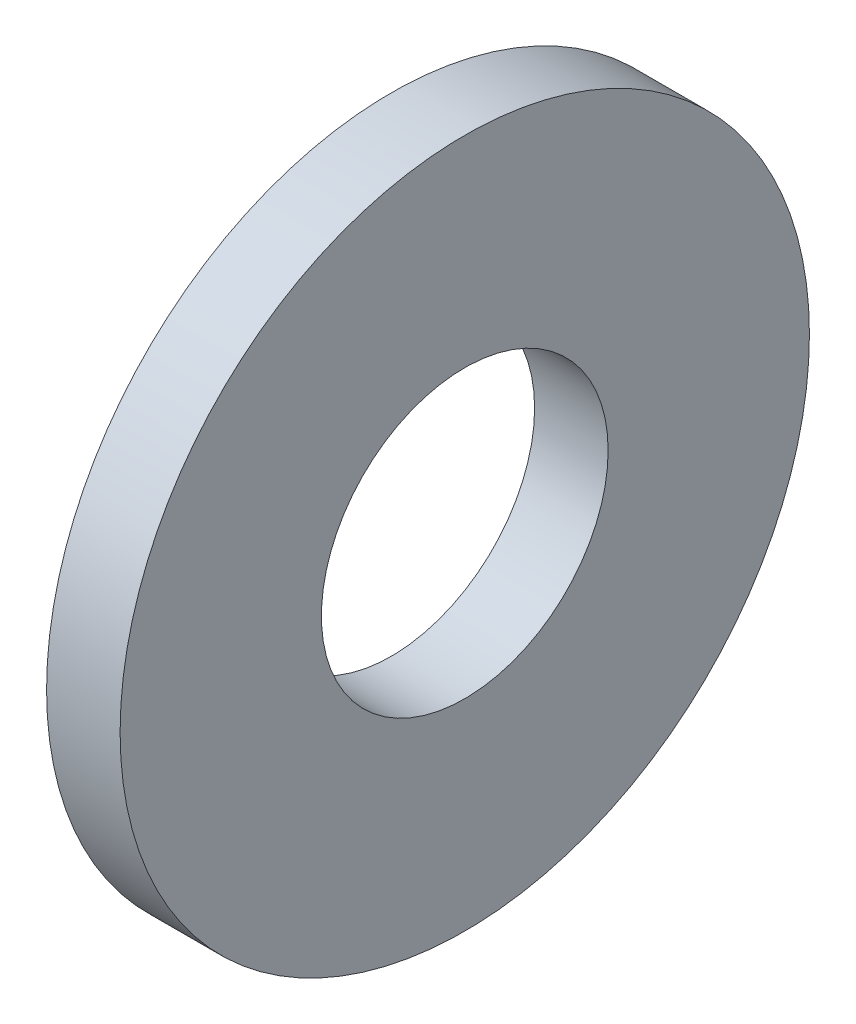
ISO-10303-21;
HEADER;
FILE_DESCRIPTION(('STEP AP214'),'2;1');
FILE_NAME('part.step','',(''),(''),'','','');
FILE_SCHEMA(('AUTOMOTIVE_DESIGN { 1 0 10303 214 1 1 1 1 }'));
ENDSEC;
DATA;
#1=APPLICATION_CONTEXT('core data for automotive mechanical design processes');
#2=APPLICATION_PROTOCOL_DEFINITION('international standard','automotive_design',2000,#1);
#3=PRODUCT_CONTEXT('',#1,'mechanical');
#4=PRODUCT('Part','Part','',(#3));
#5=PRODUCT_RELATED_PRODUCT_CATEGORY('part','',(#4));
#6=PRODUCT_DEFINITION_FORMATION('','',#4);
#7=PRODUCT_DEFINITION_CONTEXT('part definition',#1,'design');
#8=PRODUCT_DEFINITION('design','',#6,#7);
#9=PRODUCT_DEFINITION_SHAPE('','',#8);
#10=(LENGTH_UNIT() NAMED_UNIT(*) SI_UNIT(.MILLI.,.METRE.));
#11=(NAMED_UNIT(*) PLANE_ANGLE_UNIT() SI_UNIT($,.RADIAN.));
#12=(NAMED_UNIT(*) SI_UNIT($,.STERADIAN.) SOLID_ANGLE_UNIT());
#13=UNCERTAINTY_MEASURE_WITH_UNIT(LENGTH_MEASURE(1.E-05),#10,'distance_accuracy_value','');
#14=(GEOMETRIC_REPRESENTATION_CONTEXT(3) GLOBAL_UNCERTAINTY_ASSIGNED_CONTEXT((#13)) GLOBAL_UNIT_ASSIGNED_CONTEXT((#10,
#11,#12)) REPRESENTATION_CONTEXT('',''));
#15=CARTESIAN_POINT('',(0.,0.,0.));
#16=DIRECTION('',(0.,0.,1.));
#17=DIRECTION('',(1.,0.,0.));
#18=AXIS2_PLACEMENT_3D('',#15,#16,#17);
#19=CARTESIAN_POINT('',(2.032,0.,0.));
#20=DIRECTION('',(1.,0.,0.));
#21=DIRECTION('',(0.,0.,-1.));
#22=AXIS2_PLACEMENT_3D('',#19,#20,#21);
#23=PLANE('',#22);
#24=CARTESIAN_POINT('',(2.032,0.,0.));
#25=DIRECTION('',(1.,0.,0.));
#26=DIRECTION('',(0.,0.,-1.));
#27=AXIS2_PLACEMENT_3D('',#24,#25,#26);
#28=CIRCLE('',#27,9.525);
#29=CARTESIAN_POINT('',(2.032,0.,-9.525));
#30=VERTEX_POINT('',#29);
#31=EDGE_CURVE('E10',#30,#30,#28,.T.);
#32=ORIENTED_EDGE('',*,*,#31,.T.);
#33=EDGE_LOOP('',(#32));
#34=FACE_BOUND('',#33,.T.);
#35=CARTESIAN_POINT('',(2.032,0.,0.));
#36=DIRECTION('',(1.,0.,0.));
#37=DIRECTION('',(0.,0.,-1.));
#38=AXIS2_PLACEMENT_3D('',#35,#36,#37);
#39=CIRCLE('',#38,3.9624);
#40=CARTESIAN_POINT('',(2.032,0.,-3.9624));
#41=VERTEX_POINT('',#40);
#42=EDGE_CURVE('E41',#41,#41,#39,.T.);
#43=ORIENTED_EDGE('',*,*,#42,.F.);
#44=EDGE_LOOP('',(#43));
#45=FACE_BOUND('',#44,.T.);
#46=ADVANCED_FACE('F30',(#34,#45),#23,.T.);
#47=CARTESIAN_POINT('',(0.,0.,0.));
#48=DIRECTION('',(1.,0.,0.));
#49=DIRECTION('',(0.,0.,-1.));
#50=AXIS2_PLACEMENT_3D('',#47,#48,#49);
#51=PLANE('',#50);
#52=CARTESIAN_POINT('',(0.,0.,0.));
#53=DIRECTION('',(1.,0.,0.));
#54=DIRECTION('',(0.,0.,-1.));
#55=AXIS2_PLACEMENT_3D('',#52,#53,#54);
#56=CIRCLE('',#55,9.525);
#57=CARTESIAN_POINT('',(0.,0.,-9.525));
#58=VERTEX_POINT('',#57);
#59=EDGE_CURVE('E34',#58,#58,#56,.T.);
#60=ORIENTED_EDGE('',*,*,#59,.F.);
#61=EDGE_LOOP('',(#60));
#62=FACE_BOUND('',#61,.T.);
#63=CARTESIAN_POINT('',(0.,0.,0.));
#64=DIRECTION('',(1.,0.,0.));
#65=DIRECTION('',(0.,0.,-1.));
#66=AXIS2_PLACEMENT_3D('',#63,#64,#65);
#67=CIRCLE('',#66,3.9624);
#68=CARTESIAN_POINT('',(0.,0.,-3.9624));
#69=VERTEX_POINT('',#68);
#70=EDGE_CURVE('E43',#69,#69,#67,.T.);
#71=ORIENTED_EDGE('',*,*,#70,.T.);
#72=EDGE_LOOP('',(#71));
#73=FACE_BOUND('',#72,.T.);
#74=ADVANCED_FACE('F53',(#62,#73),#51,.F.);
#75=CARTESIAN_POINT('',(2.032,0.,0.));
#76=DIRECTION('',(-1.,0.,0.));
#77=DIRECTION('',(0.,0.,1.));
#78=AXIS2_PLACEMENT_3D('',#75,#76,#77);
#79=CYLINDRICAL_SURFACE('',#78,9.525);
#80=ORIENTED_EDGE('',*,*,#31,.F.);
#81=EDGE_LOOP('',(#80));
#82=FACE_BOUND('',#81,.T.);
#83=ORIENTED_EDGE('',*,*,#59,.T.);
#84=EDGE_LOOP('',(#83));
#85=FACE_BOUND('',#84,.T.);
#86=ADVANCED_FACE('F32',(#82,#85),#79,.T.);
#87=CARTESIAN_POINT('',(2.032,0.,0.));
#88=DIRECTION('',(-1.,0.,0.));
#89=DIRECTION('',(0.,0.,1.));
#90=AXIS2_PLACEMENT_3D('',#87,#88,#89);
#91=CYLINDRICAL_SURFACE('',#90,3.9624);
#92=ORIENTED_EDGE('',*,*,#42,.T.);
#93=EDGE_LOOP('',(#92));
#94=FACE_BOUND('',#93,.T.);
#95=ORIENTED_EDGE('',*,*,#70,.F.);
#96=EDGE_LOOP('',(#95));
#97=FACE_BOUND('',#96,.T.);
#98=ADVANCED_FACE('F49',(#94,#97),#91,.F.);
#99=CLOSED_SHELL('',(#46,#74,#86,#98));
#100=MANIFOLD_SOLID_BREP('B2',#99);
#101=ADVANCED_BREP_SHAPE_REPRESENTATION('',(#18,#100),#14);
#102=SHAPE_DEFINITION_REPRESENTATION(#9,#101);
ENDSEC;
END-ISO-10303-21;
